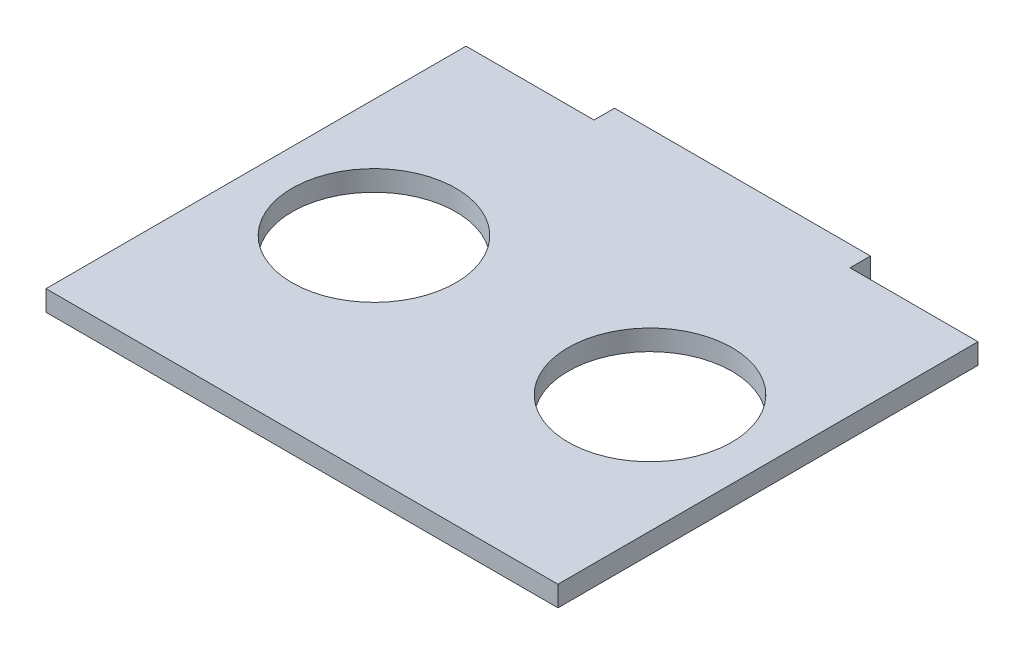
ISO-10303-21;
HEADER;
FILE_DESCRIPTION(('STEP AP214'),'2;1');
FILE_NAME('part.step','',(''),(''),'','','');
FILE_SCHEMA(('AUTOMOTIVE_DESIGN { 1 0 10303 214 1 1 1 1 }'));
ENDSEC;
DATA;
#1=APPLICATION_CONTEXT('core data for automotive mechanical design processes');
#2=APPLICATION_PROTOCOL_DEFINITION('international standard','automotive_design',2000,#1);
#3=PRODUCT_CONTEXT('',#1,'mechanical');
#4=PRODUCT('Part','Part','',(#3));
#5=PRODUCT_RELATED_PRODUCT_CATEGORY('part','',(#4));
#6=PRODUCT_DEFINITION_FORMATION('','',#4);
#7=PRODUCT_DEFINITION_CONTEXT('part definition',#1,'design');
#8=PRODUCT_DEFINITION('design','',#6,#7);
#9=PRODUCT_DEFINITION_SHAPE('','',#8);
#10=(LENGTH_UNIT() NAMED_UNIT(*) SI_UNIT(.MILLI.,.METRE.));
#11=(NAMED_UNIT(*) PLANE_ANGLE_UNIT() SI_UNIT($,.RADIAN.));
#12=(NAMED_UNIT(*) SI_UNIT($,.STERADIAN.) SOLID_ANGLE_UNIT());
#13=UNCERTAINTY_MEASURE_WITH_UNIT(LENGTH_MEASURE(1.E-05),#10,'distance_accuracy_value','');
#14=(GEOMETRIC_REPRESENTATION_CONTEXT(3) GLOBAL_UNCERTAINTY_ASSIGNED_CONTEXT((#13)) GLOBAL_UNIT_ASSIGNED_CONTEXT((#10,
#11,#12)) REPRESENTATION_CONTEXT('',''));
#15=CARTESIAN_POINT('',(0.,0.,0.));
#16=DIRECTION('',(0.,0.,1.));
#17=DIRECTION('',(1.,0.,0.));
#18=AXIS2_PLACEMENT_3D('',#15,#16,#17);
#19=CARTESIAN_POINT('',(0.,2.,0.));
#20=DIRECTION('',(0.,-1.,0.));
#21=DIRECTION('',(0.,0.,-1.));
#22=AXIS2_PLACEMENT_3D('',#19,#20,#21);
#23=PLANE('',#22);
#24=DIRECTION('',(0.,0.,-1.));
#25=VECTOR('',#24,1.);
#26=CARTESIAN_POINT('',(25.,2.,20.5114594594595));
#27=LINE('',#26,#25);
#28=CARTESIAN_POINT('',(25.,2.,20.5114594594595));
#29=VERTEX_POINT('',#28);
#30=CARTESIAN_POINT('',(25.,2.,-20.5114594594595));
#31=VERTEX_POINT('',#30);
#32=EDGE_CURVE('E147',#29,#31,#27,.T.);
#33=ORIENTED_EDGE('',*,*,#32,.T.);
#34=DIRECTION('',(-1.,0.,0.));
#35=VECTOR('',#34,1.);
#36=CARTESIAN_POINT('',(12.5,2.,-20.5114594594595));
#37=LINE('',#36,#35);
#38=CARTESIAN_POINT('',(12.5,2.,-20.5114594594595));
#39=VERTEX_POINT('',#38);
#40=EDGE_CURVE('E95',#31,#39,#37,.T.);
#41=ORIENTED_EDGE('',*,*,#40,.T.);
#42=DIRECTION('',(0.,0.,-1.));
#43=VECTOR('',#42,1.);
#44=CARTESIAN_POINT('',(12.5,2.,-22.5114594594595));
#45=LINE('',#44,#43);
#46=CARTESIAN_POINT('',(12.5,2.,-22.5114594594595));
#47=VERTEX_POINT('',#46);
#48=EDGE_CURVE('E162',#39,#47,#45,.T.);
#49=ORIENTED_EDGE('',*,*,#48,.T.);
#50=DIRECTION('',(-1.,0.,0.));
#51=VECTOR('',#50,1.);
#52=CARTESIAN_POINT('',(-12.5,2.,-22.5114594594595));
#53=LINE('',#52,#51);
#54=CARTESIAN_POINT('',(-12.5,2.,-22.5114594594595));
#55=VERTEX_POINT('',#54);
#56=EDGE_CURVE('E175',#47,#55,#53,.T.);
#57=ORIENTED_EDGE('',*,*,#56,.T.);
#58=DIRECTION('',(0.,0.,1.));
#59=VECTOR('',#58,1.);
#60=CARTESIAN_POINT('',(-12.5,2.,-22.5114594594595));
#61=LINE('',#60,#59);
#62=CARTESIAN_POINT('',(-12.5,2.,-20.5114594594595));
#63=VERTEX_POINT('',#62);
#64=EDGE_CURVE('E114',#55,#63,#61,.T.);
#65=ORIENTED_EDGE('',*,*,#64,.T.);
#66=DIRECTION('',(-1.,0.,0.));
#67=VECTOR('',#66,1.);
#68=CARTESIAN_POINT('',(-25.,2.,-20.5114594594595));
#69=LINE('',#68,#67);
#70=CARTESIAN_POINT('',(-25.,2.,-20.5114594594595));
#71=VERTEX_POINT('',#70);
#72=EDGE_CURVE('E108',#63,#71,#69,.T.);
#73=ORIENTED_EDGE('',*,*,#72,.T.);
#74=DIRECTION('',(0.,0.,1.));
#75=VECTOR('',#74,1.);
#76=CARTESIAN_POINT('',(-25.,2.,20.5114594594595));
#77=LINE('',#76,#75);
#78=CARTESIAN_POINT('',(-25.,2.,20.5114594594595));
#79=VERTEX_POINT('',#78);
#80=EDGE_CURVE('E112',#71,#79,#77,.T.);
#81=ORIENTED_EDGE('',*,*,#80,.T.);
#82=DIRECTION('',(1.,0.,0.));
#83=VECTOR('',#82,1.);
#84=CARTESIAN_POINT('',(-25.,2.,20.5114594594595));
#85=LINE('',#84,#83);
#86=EDGE_CURVE('E52',#79,#29,#85,.T.);
#87=ORIENTED_EDGE('',*,*,#86,.T.);
#88=EDGE_LOOP('',(#33,#41,#49,#57,#65,#73,#81,#87));
#89=FACE_BOUND('',#88,.T.);
#90=CARTESIAN_POINT('',(-13.48,2.,0.));
#91=DIRECTION('',(0.,1.,0.));
#92=DIRECTION('',(0.,0.,1.));
#93=AXIS2_PLACEMENT_3D('',#90,#91,#92);
#94=CIRCLE('',#93,8.);
#95=CARTESIAN_POINT('',(-13.48,2.,8.));
#96=VERTEX_POINT('',#95);
#97=EDGE_CURVE('E136',#96,#96,#94,.T.);
#98=ORIENTED_EDGE('',*,*,#97,.F.);
#99=EDGE_LOOP('',(#98));
#100=FACE_BOUND('',#99,.T.);
#101=CARTESIAN_POINT('',(13.48,2.,0.));
#102=DIRECTION('',(0.,1.,0.));
#103=DIRECTION('',(0.,0.,-1.));
#104=AXIS2_PLACEMENT_3D('',#101,#102,#103);
#105=CIRCLE('',#104,8.);
#106=CARTESIAN_POINT('',(13.48,2.,-8.));
#107=VERTEX_POINT('',#106);
#108=EDGE_CURVE('E184',#107,#107,#105,.T.);
#109=ORIENTED_EDGE('',*,*,#108,.F.);
#110=EDGE_LOOP('',(#109));
#111=FACE_BOUND('',#110,.T.);
#112=ADVANCED_FACE('F35',(#89,#100,#111),#23,.F.);
#113=CARTESIAN_POINT('',(0.,0.,0.));
#114=DIRECTION('',(0.,-1.,0.));
#115=DIRECTION('',(0.,0.,-1.));
#116=AXIS2_PLACEMENT_3D('',#113,#114,#115);
#117=PLANE('',#116);
#118=CARTESIAN_POINT('',(-13.48,0.,0.));
#119=DIRECTION('',(0.,1.,0.));
#120=DIRECTION('',(0.,0.,1.));
#121=AXIS2_PLACEMENT_3D('',#118,#119,#120);
#122=CIRCLE('',#121,8.);
#123=CARTESIAN_POINT('',(-13.48,0.,8.));
#124=VERTEX_POINT('',#123);
#125=EDGE_CURVE('E181',#124,#124,#122,.T.);
#126=ORIENTED_EDGE('',*,*,#125,.T.);
#127=EDGE_LOOP('',(#126));
#128=FACE_BOUND('',#127,.T.);
#129=DIRECTION('',(0.,0.,-1.));
#130=VECTOR('',#129,1.);
#131=CARTESIAN_POINT('',(25.,0.,20.5114594594595));
#132=LINE('',#131,#130);
#133=CARTESIAN_POINT('',(25.,0.,20.5114594594595));
#134=VERTEX_POINT('',#133);
#135=CARTESIAN_POINT('',(25.,0.,-20.5114594594595));
#136=VERTEX_POINT('',#135);
#137=EDGE_CURVE('E132',#134,#136,#132,.T.);
#138=ORIENTED_EDGE('',*,*,#137,.F.);
#139=DIRECTION('',(1.,0.,0.));
#140=VECTOR('',#139,1.);
#141=CARTESIAN_POINT('',(-25.,0.,20.5114594594595));
#142=LINE('',#141,#140);
#143=CARTESIAN_POINT('',(-25.,0.,20.5114594594595));
#144=VERTEX_POINT('',#143);
#145=EDGE_CURVE('E87',#144,#134,#142,.T.);
#146=ORIENTED_EDGE('',*,*,#145,.F.);
#147=DIRECTION('',(0.,0.,1.));
#148=VECTOR('',#147,1.);
#149=CARTESIAN_POINT('',(-25.,0.,20.5114594594595));
#150=LINE('',#149,#148);
#151=CARTESIAN_POINT('',(-25.,0.,-20.5114594594595));
#152=VERTEX_POINT('',#151);
#153=EDGE_CURVE('E81',#152,#144,#150,.T.);
#154=ORIENTED_EDGE('',*,*,#153,.F.);
#155=DIRECTION('',(-1.,0.,0.));
#156=VECTOR('',#155,1.);
#157=CARTESIAN_POINT('',(-25.,0.,-20.5114594594595));
#158=LINE('',#157,#156);
#159=CARTESIAN_POINT('',(-12.5,0.,-20.5114594594595));
#160=VERTEX_POINT('',#159);
#161=EDGE_CURVE('E122',#160,#152,#158,.T.);
#162=ORIENTED_EDGE('',*,*,#161,.F.);
#163=DIRECTION('',(0.,0.,1.));
#164=VECTOR('',#163,1.);
#165=CARTESIAN_POINT('',(-12.5,0.,-22.5114594594595));
#166=LINE('',#165,#164);
#167=CARTESIAN_POINT('',(-12.5,0.,-22.5114594594595));
#168=VERTEX_POINT('',#167);
#169=EDGE_CURVE('E142',#168,#160,#166,.T.);
#170=ORIENTED_EDGE('',*,*,#169,.F.);
#171=DIRECTION('',(-1.,0.,0.));
#172=VECTOR('',#171,1.);
#173=CARTESIAN_POINT('',(-12.5,0.,-22.5114594594595));
#174=LINE('',#173,#172);
#175=CARTESIAN_POINT('',(12.5,0.,-22.5114594594595));
#176=VERTEX_POINT('',#175);
#177=EDGE_CURVE('E140',#176,#168,#174,.T.);
#178=ORIENTED_EDGE('',*,*,#177,.F.);
#179=DIRECTION('',(0.,0.,-1.));
#180=VECTOR('',#179,1.);
#181=CARTESIAN_POINT('',(12.5,0.,-22.5114594594595));
#182=LINE('',#181,#180);
#183=CARTESIAN_POINT('',(12.5,0.,-20.5114594594595));
#184=VERTEX_POINT('',#183);
#185=EDGE_CURVE('E138',#184,#176,#182,.T.);
#186=ORIENTED_EDGE('',*,*,#185,.F.);
#187=DIRECTION('',(-1.,0.,0.));
#188=VECTOR('',#187,1.);
#189=CARTESIAN_POINT('',(12.5,0.,-20.5114594594595));
#190=LINE('',#189,#188);
#191=EDGE_CURVE('E135',#136,#184,#190,.T.);
#192=ORIENTED_EDGE('',*,*,#191,.F.);
#193=EDGE_LOOP('',(#138,#146,#154,#162,#170,#178,#186,#192));
#194=FACE_BOUND('',#193,.T.);
#195=CARTESIAN_POINT('',(13.48,0.,0.));
#196=DIRECTION('',(0.,1.,0.));
#197=DIRECTION('',(0.,0.,-1.));
#198=AXIS2_PLACEMENT_3D('',#195,#196,#197);
#199=CIRCLE('',#198,8.);
#200=CARTESIAN_POINT('',(13.48,0.,-8.));
#201=VERTEX_POINT('',#200);
#202=EDGE_CURVE('E187',#201,#201,#199,.T.);
#203=ORIENTED_EDGE('',*,*,#202,.T.);
#204=EDGE_LOOP('',(#203));
#205=FACE_BOUND('',#204,.T.);
#206=ADVANCED_FACE('F166',(#128,#194,#205),#117,.T.);
#207=CARTESIAN_POINT('',(25.,2.,20.5114594594595));
#208=DIRECTION('',(-1.,0.,0.));
#209=DIRECTION('',(0.,0.,1.));
#210=AXIS2_PLACEMENT_3D('',#207,#208,#209);
#211=PLANE('',#210);
#212=ORIENTED_EDGE('',*,*,#137,.T.);
#213=DIRECTION('',(0.,-1.,0.));
#214=VECTOR('',#213,1.);
#215=CARTESIAN_POINT('',(25.,2.,-20.5114594594595));
#216=LINE('',#215,#214);
#217=EDGE_CURVE('E11',#31,#136,#216,.T.);
#218=ORIENTED_EDGE('',*,*,#217,.F.);
#219=ORIENTED_EDGE('',*,*,#32,.F.);
#220=DIRECTION('',(0.,-1.,0.));
#221=VECTOR('',#220,1.);
#222=CARTESIAN_POINT('',(25.,2.,20.5114594594595));
#223=LINE('',#222,#221);
#224=EDGE_CURVE('E128',#29,#134,#223,.T.);
#225=ORIENTED_EDGE('',*,*,#224,.T.);
#226=EDGE_LOOP('',(#212,#218,#219,#225));
#227=FACE_BOUND('',#226,.T.);
#228=ADVANCED_FACE('F37',(#227),#211,.F.);
#229=CARTESIAN_POINT('',(12.5,2.,-20.5114594594595));
#230=DIRECTION('',(0.,0.,1.));
#231=DIRECTION('',(1.,0.,0.));
#232=AXIS2_PLACEMENT_3D('',#229,#230,#231);
#233=PLANE('',#232);
#234=ORIENTED_EDGE('',*,*,#191,.T.);
#235=DIRECTION('',(0.,-1.,0.));
#236=VECTOR('',#235,1.);
#237=CARTESIAN_POINT('',(12.5,2.,-20.5114594594595));
#238=LINE('',#237,#236);
#239=EDGE_CURVE('E44',#39,#184,#238,.T.);
#240=ORIENTED_EDGE('',*,*,#239,.F.);
#241=ORIENTED_EDGE('',*,*,#40,.F.);
#242=ORIENTED_EDGE('',*,*,#217,.T.);
#243=EDGE_LOOP('',(#234,#240,#241,#242));
#244=FACE_BOUND('',#243,.T.);
#245=ADVANCED_FACE('F219',(#244),#233,.F.);
#246=CARTESIAN_POINT('',(12.5,2.,-22.5114594594595));
#247=DIRECTION('',(-1.,0.,0.));
#248=DIRECTION('',(0.,0.,1.));
#249=AXIS2_PLACEMENT_3D('',#246,#247,#248);
#250=PLANE('',#249);
#251=ORIENTED_EDGE('',*,*,#185,.T.);
#252=DIRECTION('',(0.,-1.,0.));
#253=VECTOR('',#252,1.);
#254=CARTESIAN_POINT('',(12.5,2.,-22.5114594594595));
#255=LINE('',#254,#253);
#256=EDGE_CURVE('E154',#47,#176,#255,.T.);
#257=ORIENTED_EDGE('',*,*,#256,.F.);
#258=ORIENTED_EDGE('',*,*,#48,.F.);
#259=ORIENTED_EDGE('',*,*,#239,.T.);
#260=EDGE_LOOP('',(#251,#257,#258,#259));
#261=FACE_BOUND('',#260,.T.);
#262=ADVANCED_FACE('F160',(#261),#250,.F.);
#263=CARTESIAN_POINT('',(-12.5,2.,-22.5114594594595));
#264=DIRECTION('',(0.,0.,1.));
#265=DIRECTION('',(1.,0.,0.));
#266=AXIS2_PLACEMENT_3D('',#263,#264,#265);
#267=PLANE('',#266);
#268=ORIENTED_EDGE('',*,*,#177,.T.);
#269=DIRECTION('',(0.,-1.,0.));
#270=VECTOR('',#269,1.);
#271=CARTESIAN_POINT('',(-12.5,2.,-22.5114594594595));
#272=LINE('',#271,#270);
#273=EDGE_CURVE('E151',#55,#168,#272,.T.);
#274=ORIENTED_EDGE('',*,*,#273,.F.);
#275=ORIENTED_EDGE('',*,*,#56,.F.);
#276=ORIENTED_EDGE('',*,*,#256,.T.);
#277=EDGE_LOOP('',(#268,#274,#275,#276));
#278=FACE_BOUND('',#277,.T.);
#279=ADVANCED_FACE('F171',(#278),#267,.F.);
#280=CARTESIAN_POINT('',(-12.5,2.,-22.5114594594595));
#281=DIRECTION('',(1.,0.,0.));
#282=DIRECTION('',(0.,0.,-1.));
#283=AXIS2_PLACEMENT_3D('',#280,#281,#282);
#284=PLANE('',#283);
#285=ORIENTED_EDGE('',*,*,#169,.T.);
#286=DIRECTION('',(0.,-1.,0.));
#287=VECTOR('',#286,1.);
#288=CARTESIAN_POINT('',(-12.5,2.,-20.5114594594595));
#289=LINE('',#288,#287);
#290=EDGE_CURVE('E123',#63,#160,#289,.T.);
#291=ORIENTED_EDGE('',*,*,#290,.F.);
#292=ORIENTED_EDGE('',*,*,#64,.F.);
#293=ORIENTED_EDGE('',*,*,#273,.T.);
#294=EDGE_LOOP('',(#285,#291,#292,#293));
#295=FACE_BOUND('',#294,.T.);
#296=ADVANCED_FACE('F174',(#295),#284,.F.);
#297=CARTESIAN_POINT('',(-25.,2.,-20.5114594594595));
#298=DIRECTION('',(0.,0.,1.));
#299=DIRECTION('',(1.,0.,0.));
#300=AXIS2_PLACEMENT_3D('',#297,#298,#299);
#301=PLANE('',#300);
#302=ORIENTED_EDGE('',*,*,#161,.T.);
#303=DIRECTION('',(0.,-1.,0.));
#304=VECTOR('',#303,1.);
#305=CARTESIAN_POINT('',(-25.,2.,-20.5114594594595));
#306=LINE('',#305,#304);
#307=EDGE_CURVE('E119',#71,#152,#306,.T.);
#308=ORIENTED_EDGE('',*,*,#307,.F.);
#309=ORIENTED_EDGE('',*,*,#72,.F.);
#310=ORIENTED_EDGE('',*,*,#290,.T.);
#311=EDGE_LOOP('',(#302,#308,#309,#310));
#312=FACE_BOUND('',#311,.T.);
#313=ADVANCED_FACE('F120',(#312),#301,.F.);
#314=CARTESIAN_POINT('',(-25.,2.,20.5114594594595));
#315=DIRECTION('',(1.,0.,0.));
#316=DIRECTION('',(0.,0.,-1.));
#317=AXIS2_PLACEMENT_3D('',#314,#315,#316);
#318=PLANE('',#317);
#319=ORIENTED_EDGE('',*,*,#153,.T.);
#320=DIRECTION('',(0.,-1.,0.));
#321=VECTOR('',#320,1.);
#322=CARTESIAN_POINT('',(-25.,2.,20.5114594594595));
#323=LINE('',#322,#321);
#324=EDGE_CURVE('E124',#79,#144,#323,.T.);
#325=ORIENTED_EDGE('',*,*,#324,.F.);
#326=ORIENTED_EDGE('',*,*,#80,.F.);
#327=ORIENTED_EDGE('',*,*,#307,.T.);
#328=EDGE_LOOP('',(#319,#325,#326,#327));
#329=FACE_BOUND('',#328,.T.);
#330=ADVANCED_FACE('F126',(#329),#318,.F.);
#331=CARTESIAN_POINT('',(-25.,2.,20.5114594594595));
#332=DIRECTION('',(0.,0.,-1.));
#333=DIRECTION('',(-1.,0.,0.));
#334=AXIS2_PLACEMENT_3D('',#331,#332,#333);
#335=PLANE('',#334);
#336=ORIENTED_EDGE('',*,*,#145,.T.);
#337=ORIENTED_EDGE('',*,*,#224,.F.);
#338=ORIENTED_EDGE('',*,*,#86,.F.);
#339=ORIENTED_EDGE('',*,*,#324,.T.);
#340=EDGE_LOOP('',(#336,#337,#338,#339));
#341=FACE_BOUND('',#340,.T.);
#342=ADVANCED_FACE('F207',(#341),#335,.F.);
#343=CARTESIAN_POINT('',(-13.48,2.,0.));
#344=DIRECTION('',(0.,-1.,0.));
#345=DIRECTION('',(0.,0.,-1.));
#346=AXIS2_PLACEMENT_3D('',#343,#344,#345);
#347=CYLINDRICAL_SURFACE('',#346,8.);
#348=ORIENTED_EDGE('',*,*,#97,.T.);
#349=EDGE_LOOP('',(#348));
#350=FACE_BOUND('',#349,.T.);
#351=ORIENTED_EDGE('',*,*,#125,.F.);
#352=EDGE_LOOP('',(#351));
#353=FACE_BOUND('',#352,.T.);
#354=ADVANCED_FACE('F204',(#350,#353),#347,.F.);
#355=CARTESIAN_POINT('',(13.48,2.,0.));
#356=DIRECTION('',(0.,-1.,0.));
#357=DIRECTION('',(0.,0.,-1.));
#358=AXIS2_PLACEMENT_3D('',#355,#356,#357);
#359=CYLINDRICAL_SURFACE('',#358,8.);
#360=ORIENTED_EDGE('',*,*,#108,.T.);
#361=EDGE_LOOP('',(#360));
#362=FACE_BOUND('',#361,.T.);
#363=ORIENTED_EDGE('',*,*,#202,.F.);
#364=EDGE_LOOP('',(#363));
#365=FACE_BOUND('',#364,.T.);
#366=ADVANCED_FACE('F193',(#362,#365),#359,.F.);
#367=CLOSED_SHELL('',(#112,#206,#228,#245,#262,#279,#296,#313,#330,#342,#354,#366));
#368=MANIFOLD_SOLID_BREP('B2',#367);
#369=ADVANCED_BREP_SHAPE_REPRESENTATION('',(#18,#368),#14);
#370=SHAPE_DEFINITION_REPRESENTATION(#9,#369);
ENDSEC;
END-ISO-10303-21;
